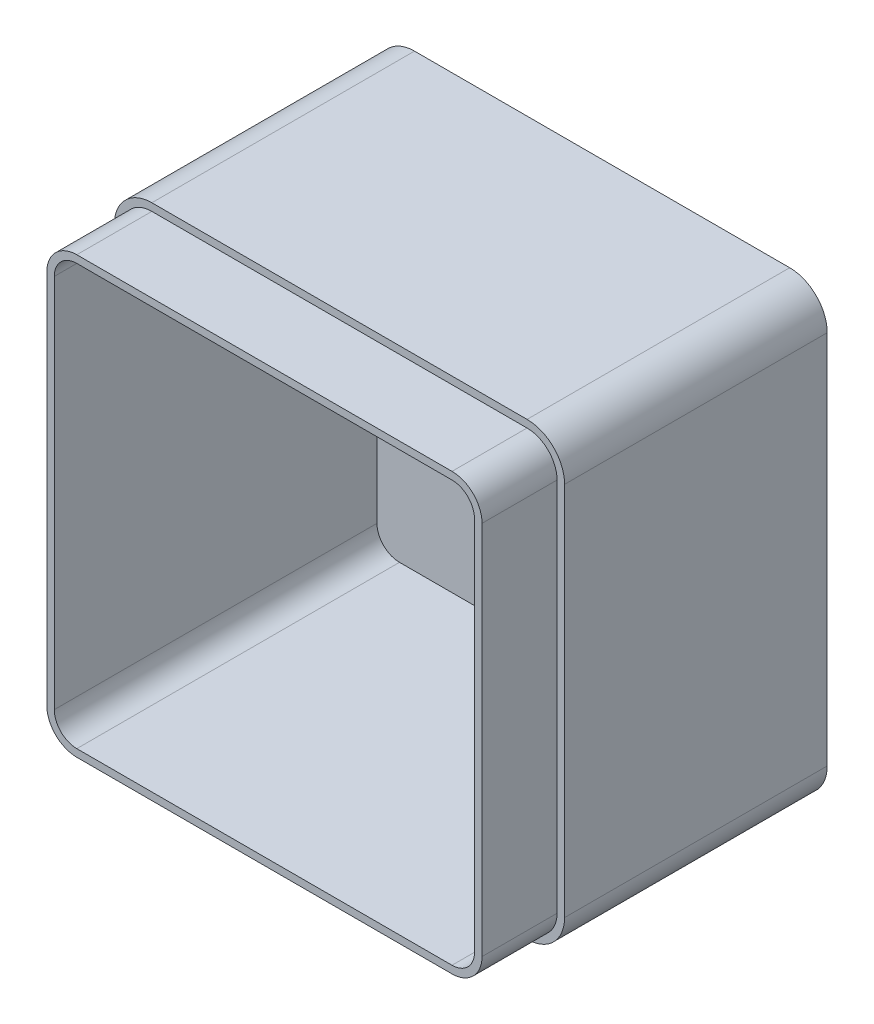
ISO-10303-21;
HEADER;
FILE_DESCRIPTION(('STEP AP214'),'2;1');
FILE_NAME('part.step','',(''),(''),'','','');
FILE_SCHEMA(('AUTOMOTIVE_DESIGN { 1 0 10303 214 1 1 1 1 }'));
ENDSEC;
DATA;
#1=APPLICATION_CONTEXT('core data for automotive mechanical design processes');
#2=APPLICATION_PROTOCOL_DEFINITION('international standard','automotive_design',2000,#1);
#3=PRODUCT_CONTEXT('',#1,'mechanical');
#4=PRODUCT('Part','Part','',(#3));
#5=PRODUCT_RELATED_PRODUCT_CATEGORY('part','',(#4));
#6=PRODUCT_DEFINITION_FORMATION('','',#4);
#7=PRODUCT_DEFINITION_CONTEXT('part definition',#1,'design');
#8=PRODUCT_DEFINITION('design','',#6,#7);
#9=PRODUCT_DEFINITION_SHAPE('','',#8);
#10=(LENGTH_UNIT() NAMED_UNIT(*) SI_UNIT(.MILLI.,.METRE.));
#11=(NAMED_UNIT(*) PLANE_ANGLE_UNIT() SI_UNIT($,.RADIAN.));
#12=(NAMED_UNIT(*) SI_UNIT($,.STERADIAN.) SOLID_ANGLE_UNIT());
#13=UNCERTAINTY_MEASURE_WITH_UNIT(LENGTH_MEASURE(1.E-05),#10,'distance_accuracy_value','');
#14=(GEOMETRIC_REPRESENTATION_CONTEXT(3) GLOBAL_UNCERTAINTY_ASSIGNED_CONTEXT((#13)) GLOBAL_UNIT_ASSIGNED_CONTEXT((#10,
#11,#12)) REPRESENTATION_CONTEXT('',''));
#15=CARTESIAN_POINT('',(0.,0.,0.));
#16=DIRECTION('',(0.,0.,1.));
#17=DIRECTION('',(1.,0.,0.));
#18=AXIS2_PLACEMENT_3D('',#15,#16,#17);
#19=CARTESIAN_POINT('',(0.,0.,90.));
#20=DIRECTION('',(0.,0.,1.));
#21=DIRECTION('',(1.,0.,0.));
#22=AXIS2_PLACEMENT_3D('',#19,#20,#21);
#23=PLANE('',#22);
#24=DIRECTION('',(0.,-1.,0.));
#25=VECTOR('',#24,1.);
#26=CARTESIAN_POINT('',(-52.5864332603939,41.3566739606127,90.));
#27=LINE('',#26,#25);
#28=CARTESIAN_POINT('',(-52.5864332603939,31.3566739606127,90.));
#29=VERTEX_POINT('',#28);
#30=CARTESIAN_POINT('',(-52.5864332603938,-68.6433260393873,90.));
#31=VERTEX_POINT('',#30);
#32=EDGE_CURVE('E349',#29,#31,#27,.T.);
#33=ORIENTED_EDGE('',*,*,#32,.F.);
#34=CARTESIAN_POINT('',(-46.5864332603939,31.3566739606127,90.));
#35=DIRECTION('',(0.,0.,1.));
#36=DIRECTION('',(1.,0.,0.));
#37=AXIS2_PLACEMENT_3D('',#34,#35,#36);
#38=CIRCLE('',#37,6.);
#39=CARTESIAN_POINT('',(-46.5864332603939,37.3566739606127,90.));
#40=VERTEX_POINT('',#39);
#41=EDGE_CURVE('E327',#40,#29,#38,.T.);
#42=ORIENTED_EDGE('',*,*,#41,.F.);
#43=DIRECTION('',(-1.,0.,0.));
#44=VECTOR('',#43,1.);
#45=CARTESIAN_POINT('',(-56.5864332603939,37.3566739606127,90.));
#46=LINE('',#45,#44);
#47=CARTESIAN_POINT('',(53.4135667396061,37.3566739606127,90.));
#48=VERTEX_POINT('',#47);
#49=EDGE_CURVE('E363',#48,#40,#46,.T.);
#50=ORIENTED_EDGE('',*,*,#49,.F.);
#51=CARTESIAN_POINT('',(53.4135667396061,31.3566739606127,90.));
#52=DIRECTION('',(0.,0.,1.));
#53=DIRECTION('',(1.,0.,0.));
#54=AXIS2_PLACEMENT_3D('',#51,#52,#53);
#55=CIRCLE('',#54,6.);
#56=CARTESIAN_POINT('',(59.4135667396061,31.3566739606127,90.));
#57=VERTEX_POINT('',#56);
#58=EDGE_CURVE('E394',#57,#48,#55,.T.);
#59=ORIENTED_EDGE('',*,*,#58,.F.);
#60=DIRECTION('',(0.,1.,0.));
#61=VECTOR('',#60,1.);
#62=CARTESIAN_POINT('',(59.4135667396061,41.3566739606127,90.));
#63=LINE('',#62,#61);
#64=CARTESIAN_POINT('',(59.4135667396061,-68.6433260393873,90.));
#65=VERTEX_POINT('',#64);
#66=EDGE_CURVE('E391',#65,#57,#63,.T.);
#67=ORIENTED_EDGE('',*,*,#66,.F.);
#68=CARTESIAN_POINT('',(53.4135667396061,-68.6433260393873,90.));
#69=DIRECTION('',(0.,0.,1.));
#70=DIRECTION('',(1.,0.,0.));
#71=AXIS2_PLACEMENT_3D('',#68,#69,#70);
#72=CIRCLE('',#71,6.);
#73=CARTESIAN_POINT('',(53.4135667396061,-74.6433260393873,90.));
#74=VERTEX_POINT('',#73);
#75=EDGE_CURVE('E387',#74,#65,#72,.T.);
#76=ORIENTED_EDGE('',*,*,#75,.F.);
#77=DIRECTION('',(1.,0.,0.));
#78=VECTOR('',#77,1.);
#79=CARTESIAN_POINT('',(-56.5864332603938,-74.6433260393873,90.));
#80=LINE('',#79,#78);
#81=CARTESIAN_POINT('',(-46.5864332603939,-74.6433260393873,90.));
#82=VERTEX_POINT('',#81);
#83=EDGE_CURVE('E384',#82,#74,#80,.T.);
#84=ORIENTED_EDGE('',*,*,#83,.F.);
#85=CARTESIAN_POINT('',(-46.5864332603939,-68.6433260393873,90.));
#86=DIRECTION('',(0.,0.,1.));
#87=DIRECTION('',(1.,0.,0.));
#88=AXIS2_PLACEMENT_3D('',#85,#86,#87);
#89=CIRCLE('',#88,6.);
#90=EDGE_CURVE('E372',#31,#82,#89,.T.);
#91=ORIENTED_EDGE('',*,*,#90,.F.);
#92=EDGE_LOOP('',(#33,#42,#50,#59,#67,#76,#84,#91));
#93=FACE_BOUND('',#92,.T.);
#94=DIRECTION('',(-1.,0.,0.));
#95=VECTOR('',#94,1.);
#96=CARTESIAN_POINT('',(53.4135667396061,39.3566739606127,90.));
#97=LINE('',#96,#95);
#98=CARTESIAN_POINT('',(53.4135667396061,39.3566739606127,90.));
#99=VERTEX_POINT('',#98);
#100=CARTESIAN_POINT('',(-46.5864332603939,39.3566739606127,90.));
#101=VERTEX_POINT('',#100);
#102=EDGE_CURVE('E228',#99,#101,#97,.T.);
#103=ORIENTED_EDGE('',*,*,#102,.T.);
#104=CARTESIAN_POINT('',(-46.5864332603939,31.3566739606127,90.));
#105=DIRECTION('',(0.,0.,1.));
#106=DIRECTION('',(1.,0.,0.));
#107=AXIS2_PLACEMENT_3D('',#104,#105,#106);
#108=CIRCLE('',#107,7.99999999999999);
#109=CARTESIAN_POINT('',(-54.5864332603939,31.3566739606127,90.));
#110=VERTEX_POINT('',#109);
#111=EDGE_CURVE('E255',#101,#110,#108,.T.);
#112=ORIENTED_EDGE('',*,*,#111,.T.);
#113=DIRECTION('',(0.,-1.,0.));
#114=VECTOR('',#113,1.);
#115=CARTESIAN_POINT('',(-54.5864332603939,31.3566739606127,90.));
#116=LINE('',#115,#114);
#117=CARTESIAN_POINT('',(-54.5864332603939,-68.6433260393873,90.));
#118=VERTEX_POINT('',#117);
#119=EDGE_CURVE('E205',#110,#118,#116,.T.);
#120=ORIENTED_EDGE('',*,*,#119,.T.);
#121=CARTESIAN_POINT('',(-46.5864332603939,-68.6433260393873,90.));
#122=DIRECTION('',(0.,0.,1.));
#123=DIRECTION('',(1.,0.,0.));
#124=AXIS2_PLACEMENT_3D('',#121,#122,#123);
#125=CIRCLE('',#124,8.);
#126=CARTESIAN_POINT('',(-46.5864332603939,-76.6433260393873,90.));
#127=VERTEX_POINT('',#126);
#128=EDGE_CURVE('E54',#118,#127,#125,.T.);
#129=ORIENTED_EDGE('',*,*,#128,.T.);
#130=DIRECTION('',(1.,0.,0.));
#131=VECTOR('',#130,1.);
#132=CARTESIAN_POINT('',(-46.5864332603939,-76.6433260393873,90.));
#133=LINE('',#132,#131);
#134=CARTESIAN_POINT('',(53.4135667396061,-76.6433260393873,90.));
#135=VERTEX_POINT('',#134);
#136=EDGE_CURVE('E262',#127,#135,#133,.T.);
#137=ORIENTED_EDGE('',*,*,#136,.T.);
#138=CARTESIAN_POINT('',(53.4135667396061,-68.6433260393873,90.));
#139=DIRECTION('',(0.,0.,1.));
#140=DIRECTION('',(1.,0.,0.));
#141=AXIS2_PLACEMENT_3D('',#138,#139,#140);
#142=CIRCLE('',#141,7.99999999999999);
#143=CARTESIAN_POINT('',(61.4135667396061,-68.6433260393873,90.));
#144=VERTEX_POINT('',#143);
#145=EDGE_CURVE('E266',#135,#144,#142,.T.);
#146=ORIENTED_EDGE('',*,*,#145,.T.);
#147=DIRECTION('',(0.,1.,0.));
#148=VECTOR('',#147,1.);
#149=CARTESIAN_POINT('',(61.4135667396061,-68.6433260393873,90.));
#150=LINE('',#149,#148);
#151=CARTESIAN_POINT('',(61.4135667396061,31.3566739606127,90.));
#152=VERTEX_POINT('',#151);
#153=EDGE_CURVE('E270',#144,#152,#150,.T.);
#154=ORIENTED_EDGE('',*,*,#153,.T.);
#155=CARTESIAN_POINT('',(53.4135667396061,31.3566739606127,90.));
#156=DIRECTION('',(0.,0.,1.));
#157=DIRECTION('',(1.,0.,0.));
#158=AXIS2_PLACEMENT_3D('',#155,#156,#157);
#159=CIRCLE('',#158,8.);
#160=EDGE_CURVE('E232',#152,#99,#159,.T.);
#161=ORIENTED_EDGE('',*,*,#160,.T.);
#162=EDGE_LOOP('',(#103,#112,#120,#129,#137,#146,#154,#161));
#163=FACE_BOUND('',#162,.T.);
#164=ADVANCED_FACE('F38',(#93,#163),#23,.T.);
#165=CARTESIAN_POINT('',(-52.5864332603939,41.3566739606127,90.));
#166=DIRECTION('',(1.,0.,0.));
#167=DIRECTION('',(0.,1.,0.));
#168=AXIS2_PLACEMENT_3D('',#165,#166,#167);
#169=PLANE('',#168);
#170=DIRECTION('',(0.,-1.,0.));
#171=VECTOR('',#170,1.);
#172=CARTESIAN_POINT('',(-52.5864332603939,41.3566739606127,4.));
#173=LINE('',#172,#171);
#174=CARTESIAN_POINT('',(-52.5864332603939,31.3566739606127,4.));
#175=VERTEX_POINT('',#174);
#176=CARTESIAN_POINT('',(-52.5864332603938,-68.6433260393873,4.));
#177=VERTEX_POINT('',#176);
#178=EDGE_CURVE('E319',#175,#177,#173,.T.);
#179=ORIENTED_EDGE('',*,*,#178,.F.);
#180=DIRECTION('',(0.,0.,1.));
#181=VECTOR('',#180,1.);
#182=CARTESIAN_POINT('',(-52.5864332603939,31.3566739606127,90.));
#183=LINE('',#182,#181);
#184=EDGE_CURVE('E328',#29,#175,#183,.F.);
#185=ORIENTED_EDGE('',*,*,#184,.F.);
#186=ORIENTED_EDGE('',*,*,#32,.T.);
#187=DIRECTION('',(0.,0.,1.));
#188=VECTOR('',#187,1.);
#189=CARTESIAN_POINT('',(-52.5864332603938,-68.6433260393873,90.));
#190=LINE('',#189,#188);
#191=EDGE_CURVE('E324',#177,#31,#190,.T.);
#192=ORIENTED_EDGE('',*,*,#191,.F.);
#193=EDGE_LOOP('',(#179,#185,#186,#192));
#194=FACE_BOUND('',#193,.T.);
#195=ADVANCED_FACE('F504',(#194),#169,.T.);
#196=CARTESIAN_POINT('',(-56.5864332603938,-74.6433260393873,90.));
#197=DIRECTION('',(0.,1.,0.));
#198=DIRECTION('',(0.,0.,1.));
#199=AXIS2_PLACEMENT_3D('',#196,#197,#198);
#200=PLANE('',#199);
#201=ORIENTED_EDGE('',*,*,#83,.T.);
#202=DIRECTION('',(0.,0.,1.));
#203=VECTOR('',#202,1.);
#204=CARTESIAN_POINT('',(53.4135667396061,-74.6433260393873,90.));
#205=LINE('',#204,#203);
#206=CARTESIAN_POINT('',(53.4135667396061,-74.6433260393873,4.));
#207=VERTEX_POINT('',#206);
#208=EDGE_CURVE('E360',#207,#74,#205,.T.);
#209=ORIENTED_EDGE('',*,*,#208,.F.);
#210=DIRECTION('',(1.,0.,0.));
#211=VECTOR('',#210,1.);
#212=CARTESIAN_POINT('',(-56.5864332603938,-74.6433260393873,4.));
#213=LINE('',#212,#211);
#214=CARTESIAN_POINT('',(-46.5864332603939,-74.6433260393873,4.));
#215=VERTEX_POINT('',#214);
#216=EDGE_CURVE('E323',#215,#207,#213,.T.);
#217=ORIENTED_EDGE('',*,*,#216,.F.);
#218=DIRECTION('',(0.,0.,1.));
#219=VECTOR('',#218,1.);
#220=CARTESIAN_POINT('',(-46.5864332603939,-74.6433260393873,90.));
#221=LINE('',#220,#219);
#222=EDGE_CURVE('E344',#82,#215,#221,.F.);
#223=ORIENTED_EDGE('',*,*,#222,.F.);
#224=EDGE_LOOP('',(#201,#209,#217,#223));
#225=FACE_BOUND('',#224,.T.);
#226=ADVANCED_FACE('F510',(#225),#200,.T.);
#227=CARTESIAN_POINT('',(59.4135667396061,41.3566739606127,90.));
#228=DIRECTION('',(-1.,0.,0.));
#229=DIRECTION('',(0.,-1.,0.));
#230=AXIS2_PLACEMENT_3D('',#227,#228,#229);
#231=PLANE('',#230);
#232=ORIENTED_EDGE('',*,*,#66,.T.);
#233=DIRECTION('',(0.,0.,1.));
#234=VECTOR('',#233,1.);
#235=CARTESIAN_POINT('',(59.4135667396061,31.3566739606127,90.));
#236=LINE('',#235,#234);
#237=CARTESIAN_POINT('',(59.4135667396061,31.3566739606127,4.));
#238=VERTEX_POINT('',#237);
#239=EDGE_CURVE('E369',#238,#57,#236,.T.);
#240=ORIENTED_EDGE('',*,*,#239,.F.);
#241=DIRECTION('',(0.,1.,0.));
#242=VECTOR('',#241,1.);
#243=CARTESIAN_POINT('',(59.4135667396061,41.3566739606127,4.));
#244=LINE('',#243,#242);
#245=CARTESIAN_POINT('',(59.4135667396061,-68.6433260393873,4.));
#246=VERTEX_POINT('',#245);
#247=EDGE_CURVE('E336',#246,#238,#244,.T.);
#248=ORIENTED_EDGE('',*,*,#247,.F.);
#249=DIRECTION('',(0.,0.,1.));
#250=VECTOR('',#249,1.);
#251=CARTESIAN_POINT('',(59.4135667396061,-68.6433260393873,90.));
#252=LINE('',#251,#250);
#253=EDGE_CURVE('E364',#65,#246,#252,.F.);
#254=ORIENTED_EDGE('',*,*,#253,.F.);
#255=EDGE_LOOP('',(#232,#240,#248,#254));
#256=FACE_BOUND('',#255,.T.);
#257=ADVANCED_FACE('F539',(#256),#231,.T.);
#258=CARTESIAN_POINT('',(-56.5864332603939,37.3566739606127,90.));
#259=DIRECTION('',(0.,-1.,0.));
#260=DIRECTION('',(0.,0.,-1.));
#261=AXIS2_PLACEMENT_3D('',#258,#259,#260);
#262=PLANE('',#261);
#263=ORIENTED_EDGE('',*,*,#49,.T.);
#264=DIRECTION('',(0.,0.,-1.));
#265=VECTOR('',#264,1.);
#266=CARTESIAN_POINT('',(-46.5864332603939,37.3566739606127,90.));
#267=LINE('',#266,#265);
#268=CARTESIAN_POINT('',(-46.5864332603939,37.3566739606127,4.));
#269=VERTEX_POINT('',#268);
#270=EDGE_CURVE('E368',#269,#40,#267,.F.);
#271=ORIENTED_EDGE('',*,*,#270,.F.);
#272=DIRECTION('',(-1.,0.,0.));
#273=VECTOR('',#272,1.);
#274=CARTESIAN_POINT('',(-56.5864332603939,37.3566739606127,4.));
#275=LINE('',#274,#273);
#276=CARTESIAN_POINT('',(53.4135667396061,37.3566739606127,4.));
#277=VERTEX_POINT('',#276);
#278=EDGE_CURVE('E345',#277,#269,#275,.T.);
#279=ORIENTED_EDGE('',*,*,#278,.F.);
#280=DIRECTION('',(0.,0.,-1.));
#281=VECTOR('',#280,1.);
#282=CARTESIAN_POINT('',(53.4135667396061,37.3566739606127,90.));
#283=LINE('',#282,#281);
#284=EDGE_CURVE('E373',#48,#277,#283,.T.);
#285=ORIENTED_EDGE('',*,*,#284,.F.);
#286=EDGE_LOOP('',(#263,#271,#279,#285));
#287=FACE_BOUND('',#286,.T.);
#288=ADVANCED_FACE('F535',(#287),#262,.T.);
#289=CARTESIAN_POINT('',(0.,0.,4.));
#290=DIRECTION('',(0.,0.,1.));
#291=DIRECTION('',(1.,0.,0.));
#292=AXIS2_PLACEMENT_3D('',#289,#290,#291);
#293=PLANE('',#292);
#294=ORIENTED_EDGE('',*,*,#216,.T.);
#295=CARTESIAN_POINT('',(53.4135667396061,-68.6433260393873,4.));
#296=DIRECTION('',(0.,0.,1.));
#297=DIRECTION('',(1.,0.,0.));
#298=AXIS2_PLACEMENT_3D('',#295,#296,#297);
#299=CIRCLE('',#298,6.);
#300=EDGE_CURVE('E339',#246,#207,#299,.F.);
#301=ORIENTED_EDGE('',*,*,#300,.F.);
#302=ORIENTED_EDGE('',*,*,#247,.T.);
#303=CARTESIAN_POINT('',(53.4135667396061,31.3566739606127,4.));
#304=DIRECTION('',(0.,0.,1.));
#305=DIRECTION('',(1.,0.,0.));
#306=AXIS2_PLACEMENT_3D('',#303,#304,#305);
#307=CIRCLE('',#306,6.);
#308=EDGE_CURVE('E343',#277,#238,#307,.F.);
#309=ORIENTED_EDGE('',*,*,#308,.F.);
#310=ORIENTED_EDGE('',*,*,#278,.T.);
#311=CARTESIAN_POINT('',(-46.5864332603939,31.3566739606127,4.));
#312=DIRECTION('',(0.,0.,1.));
#313=DIRECTION('',(1.,0.,0.));
#314=AXIS2_PLACEMENT_3D('',#311,#312,#313);
#315=CIRCLE('',#314,6.);
#316=EDGE_CURVE('E340',#175,#269,#315,.F.);
#317=ORIENTED_EDGE('',*,*,#316,.F.);
#318=ORIENTED_EDGE('',*,*,#178,.T.);
#319=CARTESIAN_POINT('',(-46.5864332603939,-68.6433260393873,4.));
#320=DIRECTION('',(0.,0.,1.));
#321=DIRECTION('',(1.,0.,0.));
#322=AXIS2_PLACEMENT_3D('',#319,#320,#321);
#323=CIRCLE('',#322,6.);
#324=EDGE_CURVE('E332',#215,#177,#323,.F.);
#325=ORIENTED_EDGE('',*,*,#324,.F.);
#326=EDGE_LOOP('',(#294,#301,#302,#309,#310,#317,#318,#325));
#327=FACE_BOUND('',#326,.T.);
#328=ADVANCED_FACE('F531',(#327),#293,.T.);
#329=CARTESIAN_POINT('',(-46.5864332603939,-68.6433260393873,90.));
#330=DIRECTION('',(0.,0.,-1.));
#331=DIRECTION('',(-1.,0.,0.));
#332=AXIS2_PLACEMENT_3D('',#329,#330,#331);
#333=CYLINDRICAL_SURFACE('',#332,6.);
#334=ORIENTED_EDGE('',*,*,#90,.T.);
#335=ORIENTED_EDGE('',*,*,#222,.T.);
#336=ORIENTED_EDGE('',*,*,#324,.T.);
#337=ORIENTED_EDGE('',*,*,#191,.T.);
#338=EDGE_LOOP('',(#334,#335,#336,#337));
#339=FACE_BOUND('',#338,.T.);
#340=ADVANCED_FACE('F527',(#339),#333,.F.);
#341=CARTESIAN_POINT('',(53.4135667396061,-68.6433260393873,90.));
#342=DIRECTION('',(0.,0.,-1.));
#343=DIRECTION('',(-1.,0.,0.));
#344=AXIS2_PLACEMENT_3D('',#341,#342,#343);
#345=CYLINDRICAL_SURFACE('',#344,6.);
#346=ORIENTED_EDGE('',*,*,#75,.T.);
#347=ORIENTED_EDGE('',*,*,#253,.T.);
#348=ORIENTED_EDGE('',*,*,#300,.T.);
#349=ORIENTED_EDGE('',*,*,#208,.T.);
#350=EDGE_LOOP('',(#346,#347,#348,#349));
#351=FACE_BOUND('',#350,.T.);
#352=ADVANCED_FACE('F523',(#351),#345,.F.);
#353=CARTESIAN_POINT('',(53.4135667396061,31.3566739606127,90.));
#354=DIRECTION('',(0.,0.,-1.));
#355=DIRECTION('',(-1.,0.,0.));
#356=AXIS2_PLACEMENT_3D('',#353,#354,#355);
#357=CYLINDRICAL_SURFACE('',#356,6.);
#358=ORIENTED_EDGE('',*,*,#58,.T.);
#359=ORIENTED_EDGE('',*,*,#284,.T.);
#360=ORIENTED_EDGE('',*,*,#308,.T.);
#361=ORIENTED_EDGE('',*,*,#239,.T.);
#362=EDGE_LOOP('',(#358,#359,#360,#361));
#363=FACE_BOUND('',#362,.T.);
#364=ADVANCED_FACE('F519',(#363),#357,.F.);
#365=CARTESIAN_POINT('',(-46.5864332603939,31.3566739606127,90.));
#366=DIRECTION('',(0.,0.,-1.));
#367=DIRECTION('',(-1.,0.,0.));
#368=AXIS2_PLACEMENT_3D('',#365,#366,#367);
#369=CYLINDRICAL_SURFACE('',#368,6.);
#370=ORIENTED_EDGE('',*,*,#41,.T.);
#371=ORIENTED_EDGE('',*,*,#184,.T.);
#372=ORIENTED_EDGE('',*,*,#316,.T.);
#373=ORIENTED_EDGE('',*,*,#270,.T.);
#374=EDGE_LOOP('',(#370,#371,#372,#373));
#375=FACE_BOUND('',#374,.T.);
#376=ADVANCED_FACE('F516',(#375),#369,.F.);
#377=CARTESIAN_POINT('',(-46.5864332603939,31.3566739606127,70.));
#378=DIRECTION('',(0.,0.,1.));
#379=DIRECTION('',(1.,0.,0.));
#380=AXIS2_PLACEMENT_3D('',#377,#378,#379);
#381=PLANE('',#380);
#382=DIRECTION('',(-1.,0.,0.));
#383=VECTOR('',#382,1.);
#384=CARTESIAN_POINT('',(53.4135667396061,39.3566739606127,70.));
#385=LINE('',#384,#383);
#386=CARTESIAN_POINT('',(53.4135667396061,39.3566739606127,70.));
#387=VERTEX_POINT('',#386);
#388=CARTESIAN_POINT('',(-46.5864332603939,39.3566739606127,70.));
#389=VERTEX_POINT('',#388);
#390=EDGE_CURVE('E212',#387,#389,#385,.T.);
#391=ORIENTED_EDGE('',*,*,#390,.F.);
#392=CARTESIAN_POINT('',(53.4135667396061,31.3566739606127,70.));
#393=DIRECTION('',(0.,0.,1.));
#394=DIRECTION('',(1.,0.,0.));
#395=AXIS2_PLACEMENT_3D('',#392,#393,#394);
#396=CIRCLE('',#395,8.);
#397=CARTESIAN_POINT('',(61.4135667396061,31.3566739606127,70.));
#398=VERTEX_POINT('',#397);
#399=EDGE_CURVE('E249',#398,#387,#396,.T.);
#400=ORIENTED_EDGE('',*,*,#399,.F.);
#401=DIRECTION('',(0.,1.,0.));
#402=VECTOR('',#401,1.);
#403=CARTESIAN_POINT('',(61.4135667396061,-68.6433260393873,70.));
#404=LINE('',#403,#402);
#405=CARTESIAN_POINT('',(61.4135667396061,-68.6433260393873,70.));
#406=VERTEX_POINT('',#405);
#407=EDGE_CURVE('E245',#406,#398,#404,.T.);
#408=ORIENTED_EDGE('',*,*,#407,.F.);
#409=CARTESIAN_POINT('',(53.4135667396061,-68.6433260393873,70.));
#410=DIRECTION('',(0.,0.,1.));
#411=DIRECTION('',(1.,0.,0.));
#412=AXIS2_PLACEMENT_3D('',#409,#410,#411);
#413=CIRCLE('',#412,7.99999999999999);
#414=CARTESIAN_POINT('',(53.4135667396061,-76.6433260393873,70.));
#415=VERTEX_POINT('',#414);
#416=EDGE_CURVE('E241',#415,#406,#413,.T.);
#417=ORIENTED_EDGE('',*,*,#416,.F.);
#418=DIRECTION('',(1.,0.,0.));
#419=VECTOR('',#418,1.);
#420=CARTESIAN_POINT('',(-46.5864332603939,-76.6433260393873,70.));
#421=LINE('',#420,#419);
#422=CARTESIAN_POINT('',(-46.5864332603939,-76.6433260393873,70.));
#423=VERTEX_POINT('',#422);
#424=EDGE_CURVE('E237',#423,#415,#421,.T.);
#425=ORIENTED_EDGE('',*,*,#424,.F.);
#426=CARTESIAN_POINT('',(-46.5864332603939,-68.6433260393873,70.));
#427=DIRECTION('',(0.,0.,1.));
#428=DIRECTION('',(1.,0.,0.));
#429=AXIS2_PLACEMENT_3D('',#426,#427,#428);
#430=CIRCLE('',#429,8.);
#431=CARTESIAN_POINT('',(-54.5864332603939,-68.6433260393873,70.));
#432=VERTEX_POINT('',#431);
#433=EDGE_CURVE('E222',#432,#423,#430,.T.);
#434=ORIENTED_EDGE('',*,*,#433,.F.);
#435=DIRECTION('',(0.,-1.,0.));
#436=VECTOR('',#435,1.);
#437=CARTESIAN_POINT('',(-54.5864332603939,31.3566739606127,70.));
#438=LINE('',#437,#436);
#439=CARTESIAN_POINT('',(-54.5864332603939,31.3566739606127,70.));
#440=VERTEX_POINT('',#439);
#441=EDGE_CURVE('E203',#440,#432,#438,.T.);
#442=ORIENTED_EDGE('',*,*,#441,.F.);
#443=CARTESIAN_POINT('',(-46.5864332603939,31.3566739606127,70.));
#444=DIRECTION('',(0.,0.,1.));
#445=DIRECTION('',(1.,0.,0.));
#446=AXIS2_PLACEMENT_3D('',#443,#444,#445);
#447=CIRCLE('',#446,7.99999999999999);
#448=EDGE_CURVE('E218',#389,#440,#447,.T.);
#449=ORIENTED_EDGE('',*,*,#448,.F.);
#450=EDGE_LOOP('',(#391,#400,#408,#417,#425,#434,#442,#449));
#451=FACE_BOUND('',#450,.T.);
#452=CARTESIAN_POINT('',(-46.5864332603939,31.3566739606127,70.));
#453=DIRECTION('',(0.,0.,1.));
#454=DIRECTION('',(1.,0.,0.));
#455=AXIS2_PLACEMENT_3D('',#452,#453,#454);
#456=CIRCLE('',#455,9.99999999999999);
#457=CARTESIAN_POINT('',(-46.5864332603939,41.3566739606127,70.));
#458=VERTEX_POINT('',#457);
#459=CARTESIAN_POINT('',(-56.5864332603939,31.3566739606127,70.));
#460=VERTEX_POINT('',#459);
#461=EDGE_CURVE('E279',#458,#460,#456,.T.);
#462=ORIENTED_EDGE('',*,*,#461,.T.);
#463=DIRECTION('',(0.,-1.,0.));
#464=VECTOR('',#463,1.);
#465=CARTESIAN_POINT('',(-56.5864332603939,31.3566739606127,70.));
#466=LINE('',#465,#464);
#467=CARTESIAN_POINT('',(-56.5864332603938,-68.6433260393873,70.));
#468=VERTEX_POINT('',#467);
#469=EDGE_CURVE('E299',#460,#468,#466,.T.);
#470=ORIENTED_EDGE('',*,*,#469,.T.);
#471=CARTESIAN_POINT('',(-46.5864332603939,-68.6433260393873,70.));
#472=DIRECTION('',(0.,0.,1.));
#473=DIRECTION('',(1.,0.,0.));
#474=AXIS2_PLACEMENT_3D('',#471,#472,#473);
#475=CIRCLE('',#474,9.99999999999999);
#476=CARTESIAN_POINT('',(-46.5864332603939,-78.6433260393873,70.));
#477=VERTEX_POINT('',#476);
#478=EDGE_CURVE('E302',#468,#477,#475,.T.);
#479=ORIENTED_EDGE('',*,*,#478,.T.);
#480=DIRECTION('',(1.,0.,0.));
#481=VECTOR('',#480,1.);
#482=CARTESIAN_POINT('',(-46.5864332603939,-78.6433260393873,70.));
#483=LINE('',#482,#481);
#484=CARTESIAN_POINT('',(53.4135667396061,-78.6433260393873,70.));
#485=VERTEX_POINT('',#484);
#486=EDGE_CURVE('E305',#477,#485,#483,.T.);
#487=ORIENTED_EDGE('',*,*,#486,.T.);
#488=CARTESIAN_POINT('',(53.4135667396061,-68.6433260393873,70.));
#489=DIRECTION('',(0.,0.,1.));
#490=DIRECTION('',(1.,0.,0.));
#491=AXIS2_PLACEMENT_3D('',#488,#489,#490);
#492=CIRCLE('',#491,9.99999999999999);
#493=CARTESIAN_POINT('',(63.4135667396061,-68.6433260393873,70.));
#494=VERTEX_POINT('',#493);
#495=EDGE_CURVE('E308',#485,#494,#492,.T.);
#496=ORIENTED_EDGE('',*,*,#495,.T.);
#497=DIRECTION('',(0.,1.,0.));
#498=VECTOR('',#497,1.);
#499=CARTESIAN_POINT('',(63.4135667396061,-68.6433260393873,70.));
#500=LINE('',#499,#498);
#501=CARTESIAN_POINT('',(63.4135667396061,31.3566739606127,70.));
#502=VERTEX_POINT('',#501);
#503=EDGE_CURVE('E311',#494,#502,#500,.T.);
#504=ORIENTED_EDGE('',*,*,#503,.T.);
#505=CARTESIAN_POINT('',(53.4135667396061,31.3566739606127,70.));
#506=DIRECTION('',(0.,0.,1.));
#507=DIRECTION('',(1.,0.,0.));
#508=AXIS2_PLACEMENT_3D('',#505,#506,#507);
#509=CIRCLE('',#508,9.99999999999999);
#510=CARTESIAN_POINT('',(53.4135667396061,41.3566739606127,70.));
#511=VERTEX_POINT('',#510);
#512=EDGE_CURVE('E314',#502,#511,#509,.T.);
#513=ORIENTED_EDGE('',*,*,#512,.T.);
#514=DIRECTION('',(-1.,0.,0.));
#515=VECTOR('',#514,1.);
#516=CARTESIAN_POINT('',(53.4135667396061,41.3566739606127,70.));
#517=LINE('',#516,#515);
#518=EDGE_CURVE('E62',#511,#458,#517,.T.);
#519=ORIENTED_EDGE('',*,*,#518,.T.);
#520=EDGE_LOOP('',(#462,#470,#479,#487,#496,#504,#513,#519));
#521=FACE_BOUND('',#520,.T.);
#522=ADVANCED_FACE('F217',(#451,#521),#381,.T.);
#523=CARTESIAN_POINT('',(-46.5864332603939,31.3566739606127,70.));
#524=DIRECTION('',(0.,0.,1.));
#525=DIRECTION('',(1.,0.,0.));
#526=AXIS2_PLACEMENT_3D('',#523,#524,#525);
#527=CYLINDRICAL_SURFACE('',#526,7.99999999999999);
#528=ORIENTED_EDGE('',*,*,#111,.F.);
#529=DIRECTION('',(0.,0.,1.));
#530=VECTOR('',#529,1.);
#531=CARTESIAN_POINT('',(-46.5864332603939,39.3566739606127,70.));
#532=LINE('',#531,#530);
#533=EDGE_CURVE('E226',#389,#101,#532,.T.);
#534=ORIENTED_EDGE('',*,*,#533,.F.);
#535=ORIENTED_EDGE('',*,*,#448,.T.);
#536=DIRECTION('',(0.,0.,1.));
#537=VECTOR('',#536,1.);
#538=CARTESIAN_POINT('',(-54.5864332603939,31.3566739606127,70.));
#539=LINE('',#538,#537);
#540=EDGE_CURVE('E200',#440,#110,#539,.T.);
#541=ORIENTED_EDGE('',*,*,#540,.T.);
#542=EDGE_LOOP('',(#528,#534,#535,#541));
#543=FACE_BOUND('',#542,.T.);
#544=ADVANCED_FACE('F225',(#543),#527,.T.);
#545=CARTESIAN_POINT('',(53.4135667396061,39.3566739606127,70.));
#546=DIRECTION('',(0.,1.,0.));
#547=DIRECTION('',(0.,0.,1.));
#548=AXIS2_PLACEMENT_3D('',#545,#546,#547);
#549=PLANE('',#548);
#550=ORIENTED_EDGE('',*,*,#102,.F.);
#551=DIRECTION('',(0.,0.,1.));
#552=VECTOR('',#551,1.);
#553=CARTESIAN_POINT('',(53.4135667396061,39.3566739606127,70.));
#554=LINE('',#553,#552);
#555=EDGE_CURVE('E280',#387,#99,#554,.T.);
#556=ORIENTED_EDGE('',*,*,#555,.F.);
#557=ORIENTED_EDGE('',*,*,#390,.T.);
#558=ORIENTED_EDGE('',*,*,#533,.T.);
#559=EDGE_LOOP('',(#550,#556,#557,#558));
#560=FACE_BOUND('',#559,.T.);
#561=ADVANCED_FACE('F550',(#560),#549,.T.);
#562=CARTESIAN_POINT('',(53.4135667396061,31.3566739606127,70.));
#563=DIRECTION('',(0.,0.,1.));
#564=DIRECTION('',(1.,0.,0.));
#565=AXIS2_PLACEMENT_3D('',#562,#563,#564);
#566=CYLINDRICAL_SURFACE('',#565,8.);
#567=ORIENTED_EDGE('',*,*,#160,.F.);
#568=DIRECTION('',(0.,0.,1.));
#569=VECTOR('',#568,1.);
#570=CARTESIAN_POINT('',(61.4135667396061,31.3566739606127,70.));
#571=LINE('',#570,#569);
#572=EDGE_CURVE('E283',#398,#152,#571,.T.);
#573=ORIENTED_EDGE('',*,*,#572,.F.);
#574=ORIENTED_EDGE('',*,*,#399,.T.);
#575=ORIENTED_EDGE('',*,*,#555,.T.);
#576=EDGE_LOOP('',(#567,#573,#574,#575));
#577=FACE_BOUND('',#576,.T.);
#578=ADVANCED_FACE('F565',(#577),#566,.T.);
#579=CARTESIAN_POINT('',(61.4135667396061,-68.6433260393873,70.));
#580=DIRECTION('',(1.,0.,0.));
#581=DIRECTION('',(0.,0.,-1.));
#582=AXIS2_PLACEMENT_3D('',#579,#580,#581);
#583=PLANE('',#582);
#584=ORIENTED_EDGE('',*,*,#153,.F.);
#585=DIRECTION('',(0.,0.,1.));
#586=VECTOR('',#585,1.);
#587=CARTESIAN_POINT('',(61.4135667396061,-68.6433260393873,70.));
#588=LINE('',#587,#586);
#589=EDGE_CURVE('E286',#406,#144,#588,.T.);
#590=ORIENTED_EDGE('',*,*,#589,.F.);
#591=ORIENTED_EDGE('',*,*,#407,.T.);
#592=ORIENTED_EDGE('',*,*,#572,.T.);
#593=EDGE_LOOP('',(#584,#590,#591,#592));
#594=FACE_BOUND('',#593,.T.);
#595=ADVANCED_FACE('F561',(#594),#583,.T.);
#596=CARTESIAN_POINT('',(53.4135667396061,-68.6433260393873,70.));
#597=DIRECTION('',(0.,0.,1.));
#598=DIRECTION('',(1.,0.,0.));
#599=AXIS2_PLACEMENT_3D('',#596,#597,#598);
#600=CYLINDRICAL_SURFACE('',#599,7.99999999999999);
#601=ORIENTED_EDGE('',*,*,#145,.F.);
#602=DIRECTION('',(0.,0.,1.));
#603=VECTOR('',#602,1.);
#604=CARTESIAN_POINT('',(53.4135667396061,-76.6433260393873,70.));
#605=LINE('',#604,#603);
#606=EDGE_CURVE('E289',#415,#135,#605,.T.);
#607=ORIENTED_EDGE('',*,*,#606,.F.);
#608=ORIENTED_EDGE('',*,*,#416,.T.);
#609=ORIENTED_EDGE('',*,*,#589,.T.);
#610=EDGE_LOOP('',(#601,#607,#608,#609));
#611=FACE_BOUND('',#610,.T.);
#612=ADVANCED_FACE('F557',(#611),#600,.T.);
#613=CARTESIAN_POINT('',(-46.5864332603939,-76.6433260393873,70.));
#614=DIRECTION('',(0.,-1.,0.));
#615=DIRECTION('',(0.,0.,-1.));
#616=AXIS2_PLACEMENT_3D('',#613,#614,#615);
#617=PLANE('',#616);
#618=ORIENTED_EDGE('',*,*,#136,.F.);
#619=DIRECTION('',(0.,0.,1.));
#620=VECTOR('',#619,1.);
#621=CARTESIAN_POINT('',(-46.5864332603939,-76.6433260393873,70.));
#622=LINE('',#621,#620);
#623=EDGE_CURVE('E292',#423,#127,#622,.T.);
#624=ORIENTED_EDGE('',*,*,#623,.F.);
#625=ORIENTED_EDGE('',*,*,#424,.T.);
#626=ORIENTED_EDGE('',*,*,#606,.T.);
#627=EDGE_LOOP('',(#618,#624,#625,#626));
#628=FACE_BOUND('',#627,.T.);
#629=ADVANCED_FACE('F554',(#628),#617,.T.);
#630=CARTESIAN_POINT('',(-46.5864332603939,-68.6433260393873,70.));
#631=DIRECTION('',(0.,0.,1.));
#632=DIRECTION('',(1.,0.,0.));
#633=AXIS2_PLACEMENT_3D('',#630,#631,#632);
#634=CYLINDRICAL_SURFACE('',#633,8.);
#635=ORIENTED_EDGE('',*,*,#128,.F.);
#636=DIRECTION('',(0.,0.,1.));
#637=VECTOR('',#636,1.);
#638=CARTESIAN_POINT('',(-54.5864332603939,-68.6433260393873,70.));
#639=LINE('',#638,#637);
#640=EDGE_CURVE('E211',#432,#118,#639,.T.);
#641=ORIENTED_EDGE('',*,*,#640,.F.);
#642=ORIENTED_EDGE('',*,*,#433,.T.);
#643=ORIENTED_EDGE('',*,*,#623,.T.);
#644=EDGE_LOOP('',(#635,#641,#642,#643));
#645=FACE_BOUND('',#644,.T.);
#646=ADVANCED_FACE('F499',(#645),#634,.T.);
#647=CARTESIAN_POINT('',(-54.5864332603939,31.3566739606127,70.));
#648=DIRECTION('',(-1.,0.,0.));
#649=DIRECTION('',(0.,0.,1.));
#650=AXIS2_PLACEMENT_3D('',#647,#648,#649);
#651=PLANE('',#650);
#652=ORIENTED_EDGE('',*,*,#119,.F.);
#653=ORIENTED_EDGE('',*,*,#540,.F.);
#654=ORIENTED_EDGE('',*,*,#441,.T.);
#655=ORIENTED_EDGE('',*,*,#640,.T.);
#656=EDGE_LOOP('',(#652,#653,#654,#655));
#657=FACE_BOUND('',#656,.T.);
#658=ADVANCED_FACE('F202',(#657),#651,.T.);
#659=CARTESIAN_POINT('',(0.,0.,0.));
#660=DIRECTION('',(0.,0.,1.));
#661=DIRECTION('',(1.,0.,0.));
#662=AXIS2_PLACEMENT_3D('',#659,#660,#661);
#663=PLANE('',#662);
#664=DIRECTION('',(1.,0.,0.));
#665=VECTOR('',#664,1.);
#666=CARTESIAN_POINT('',(-56.5864332603938,-78.6433260393873,0.));
#667=LINE('',#666,#665);
#668=CARTESIAN_POINT('',(-46.5864332603939,-78.6433260393873,0.));
#669=VERTEX_POINT('',#668);
#670=CARTESIAN_POINT('',(53.4135667396061,-78.6433260393873,0.));
#671=VERTEX_POINT('',#670);
#672=EDGE_CURVE('E407',#669,#671,#667,.T.);
#673=ORIENTED_EDGE('',*,*,#672,.F.);
#674=CARTESIAN_POINT('',(-46.5864332603939,-68.6433260393873,0.));
#675=DIRECTION('',(0.,0.,1.));
#676=DIRECTION('',(1.,0.,0.));
#677=AXIS2_PLACEMENT_3D('',#674,#675,#676);
#678=CIRCLE('',#677,10.);
#679=CARTESIAN_POINT('',(-56.5864332603938,-68.6433260393873,0.));
#680=VERTEX_POINT('',#679);
#681=EDGE_CURVE('E435',#669,#680,#678,.F.);
#682=ORIENTED_EDGE('',*,*,#681,.T.);
#683=DIRECTION('',(0.,-1.,0.));
#684=VECTOR('',#683,1.);
#685=CARTESIAN_POINT('',(-56.5864332603939,41.3566739606127,0.));
#686=LINE('',#685,#684);
#687=CARTESIAN_POINT('',(-56.5864332603939,31.3566739606127,0.));
#688=VERTEX_POINT('',#687);
#689=EDGE_CURVE('E377',#688,#680,#686,.T.);
#690=ORIENTED_EDGE('',*,*,#689,.F.);
#691=CARTESIAN_POINT('',(-46.5864332603939,31.3566739606127,0.));
#692=DIRECTION('',(0.,0.,1.));
#693=DIRECTION('',(1.,0.,0.));
#694=AXIS2_PLACEMENT_3D('',#691,#692,#693);
#695=CIRCLE('',#694,10.);
#696=CARTESIAN_POINT('',(-46.5864332603939,41.3566739606127,0.));
#697=VERTEX_POINT('',#696);
#698=EDGE_CURVE('E426',#688,#697,#695,.F.);
#699=ORIENTED_EDGE('',*,*,#698,.T.);
#700=DIRECTION('',(-1.,0.,0.));
#701=VECTOR('',#700,1.);
#702=CARTESIAN_POINT('',(-56.5864332603939,41.3566739606127,0.));
#703=LINE('',#702,#701);
#704=CARTESIAN_POINT('',(53.4135667396061,41.3566739606127,0.));
#705=VERTEX_POINT('',#704);
#706=EDGE_CURVE('E415',#705,#697,#703,.T.);
#707=ORIENTED_EDGE('',*,*,#706,.F.);
#708=CARTESIAN_POINT('',(53.4135667396061,31.3566739606127,0.));
#709=DIRECTION('',(0.,0.,1.));
#710=DIRECTION('',(1.,0.,0.));
#711=AXIS2_PLACEMENT_3D('',#708,#709,#710);
#712=CIRCLE('',#711,10.);
#713=CARTESIAN_POINT('',(63.4135667396061,31.3566739606127,0.));
#714=VERTEX_POINT('',#713);
#715=EDGE_CURVE('E429',#705,#714,#712,.F.);
#716=ORIENTED_EDGE('',*,*,#715,.T.);
#717=DIRECTION('',(0.,1.,0.));
#718=VECTOR('',#717,1.);
#719=CARTESIAN_POINT('',(63.4135667396061,41.3566739606127,0.));
#720=LINE('',#719,#718);
#721=CARTESIAN_POINT('',(63.4135667396061,-68.6433260393873,0.));
#722=VERTEX_POINT('',#721);
#723=EDGE_CURVE('E411',#722,#714,#720,.T.);
#724=ORIENTED_EDGE('',*,*,#723,.F.);
#725=CARTESIAN_POINT('',(53.4135667396061,-68.6433260393873,0.));
#726=DIRECTION('',(0.,0.,1.));
#727=DIRECTION('',(1.,0.,0.));
#728=AXIS2_PLACEMENT_3D('',#725,#726,#727);
#729=CIRCLE('',#728,10.);
#730=EDGE_CURVE('E432',#722,#671,#729,.F.);
#731=ORIENTED_EDGE('',*,*,#730,.T.);
#732=EDGE_LOOP('',(#673,#682,#690,#699,#707,#716,#724,#731));
#733=FACE_BOUND('',#732,.T.);
#734=ADVANCED_FACE('F491',(#733),#663,.F.);
#735=CARTESIAN_POINT('',(-46.5864332603939,31.3566739606127,90.));
#736=DIRECTION('',(0.,0.,-1.));
#737=DIRECTION('',(-1.,0.,0.));
#738=AXIS2_PLACEMENT_3D('',#735,#736,#737);
#739=CYLINDRICAL_SURFACE('',#738,10.);
#740=DIRECTION('',(0.,0.,-1.));
#741=VECTOR('',#740,1.);
#742=CARTESIAN_POINT('',(-56.5864332603939,31.3566739606127,90.));
#743=LINE('',#742,#741);
#744=EDGE_CURVE('E438',#460,#688,#743,.T.);
#745=ORIENTED_EDGE('',*,*,#744,.F.);
#746=ORIENTED_EDGE('',*,*,#461,.F.);
#747=DIRECTION('',(0.,0.,-1.));
#748=VECTOR('',#747,1.);
#749=CARTESIAN_POINT('',(-46.5864332603939,41.3566739606127,90.));
#750=LINE('',#749,#748);
#751=EDGE_CURVE('E47',#697,#458,#750,.F.);
#752=ORIENTED_EDGE('',*,*,#751,.F.);
#753=ORIENTED_EDGE('',*,*,#698,.F.);
#754=EDGE_LOOP('',(#745,#746,#752,#753));
#755=FACE_BOUND('',#754,.T.);
#756=ADVANCED_FACE('F40',(#755),#739,.T.);
#757=CARTESIAN_POINT('',(53.4135667396061,31.3566739606127,90.));
#758=DIRECTION('',(0.,0.,-1.));
#759=DIRECTION('',(-1.,0.,0.));
#760=AXIS2_PLACEMENT_3D('',#757,#758,#759);
#761=CYLINDRICAL_SURFACE('',#760,10.);
#762=DIRECTION('',(0.,0.,-1.));
#763=VECTOR('',#762,1.);
#764=CARTESIAN_POINT('',(53.4135667396061,41.3566739606127,90.));
#765=LINE('',#764,#763);
#766=EDGE_CURVE('E11',#511,#705,#765,.T.);
#767=ORIENTED_EDGE('',*,*,#766,.F.);
#768=ORIENTED_EDGE('',*,*,#512,.F.);
#769=DIRECTION('',(0.,0.,-1.));
#770=VECTOR('',#769,1.);
#771=CARTESIAN_POINT('',(63.4135667396061,31.3566739606127,90.));
#772=LINE('',#771,#770);
#773=EDGE_CURVE('E445',#714,#502,#772,.F.);
#774=ORIENTED_EDGE('',*,*,#773,.F.);
#775=ORIENTED_EDGE('',*,*,#715,.F.);
#776=EDGE_LOOP('',(#767,#768,#774,#775));
#777=FACE_BOUND('',#776,.T.);
#778=ADVANCED_FACE('F489',(#777),#761,.T.);
#779=CARTESIAN_POINT('',(-56.5864332603939,41.3566739606127,90.));
#780=DIRECTION('',(0.,-1.,0.));
#781=DIRECTION('',(0.,0.,-1.));
#782=AXIS2_PLACEMENT_3D('',#779,#780,#781);
#783=PLANE('',#782);
#784=ORIENTED_EDGE('',*,*,#518,.F.);
#785=ORIENTED_EDGE('',*,*,#766,.T.);
#786=ORIENTED_EDGE('',*,*,#706,.T.);
#787=ORIENTED_EDGE('',*,*,#751,.T.);
#788=EDGE_LOOP('',(#784,#785,#786,#787));
#789=FACE_BOUND('',#788,.T.);
#790=ADVANCED_FACE('F455',(#789),#783,.F.);
#791=CARTESIAN_POINT('',(53.4135667396061,-68.6433260393873,90.));
#792=DIRECTION('',(0.,0.,-1.));
#793=DIRECTION('',(-1.,0.,0.));
#794=AXIS2_PLACEMENT_3D('',#791,#792,#793);
#795=CYLINDRICAL_SURFACE('',#794,10.);
#796=DIRECTION('',(0.,0.,-1.));
#797=VECTOR('',#796,1.);
#798=CARTESIAN_POINT('',(63.4135667396061,-68.6433260393873,90.));
#799=LINE('',#798,#797);
#800=EDGE_CURVE('E449',#494,#722,#799,.T.);
#801=ORIENTED_EDGE('',*,*,#800,.F.);
#802=ORIENTED_EDGE('',*,*,#495,.F.);
#803=DIRECTION('',(0.,0.,-1.));
#804=VECTOR('',#803,1.);
#805=CARTESIAN_POINT('',(53.4135667396061,-78.6433260393873,90.));
#806=LINE('',#805,#804);
#807=EDGE_CURVE('E419',#671,#485,#806,.F.);
#808=ORIENTED_EDGE('',*,*,#807,.F.);
#809=ORIENTED_EDGE('',*,*,#730,.F.);
#810=EDGE_LOOP('',(#801,#802,#808,#809));
#811=FACE_BOUND('',#810,.T.);
#812=ADVANCED_FACE('F480',(#811),#795,.T.);
#813=CARTESIAN_POINT('',(63.4135667396061,41.3566739606127,90.));
#814=DIRECTION('',(-1.,0.,0.));
#815=DIRECTION('',(0.,-1.,0.));
#816=AXIS2_PLACEMENT_3D('',#813,#814,#815);
#817=PLANE('',#816);
#818=ORIENTED_EDGE('',*,*,#503,.F.);
#819=ORIENTED_EDGE('',*,*,#800,.T.);
#820=ORIENTED_EDGE('',*,*,#723,.T.);
#821=ORIENTED_EDGE('',*,*,#773,.T.);
#822=EDGE_LOOP('',(#818,#819,#820,#821));
#823=FACE_BOUND('',#822,.T.);
#824=ADVANCED_FACE('F485',(#823),#817,.F.);
#825=CARTESIAN_POINT('',(-46.5864332603939,-68.6433260393873,90.));
#826=DIRECTION('',(0.,0.,-1.));
#827=DIRECTION('',(-1.,0.,0.));
#828=AXIS2_PLACEMENT_3D('',#825,#826,#827);
#829=CYLINDRICAL_SURFACE('',#828,10.);
#830=DIRECTION('',(0.,0.,-1.));
#831=VECTOR('',#830,1.);
#832=CARTESIAN_POINT('',(-46.5864332603939,-78.6433260393873,90.));
#833=LINE('',#832,#831);
#834=EDGE_CURVE('E423',#477,#669,#833,.T.);
#835=ORIENTED_EDGE('',*,*,#834,.F.);
#836=ORIENTED_EDGE('',*,*,#478,.F.);
#837=DIRECTION('',(0.,0.,-1.));
#838=VECTOR('',#837,1.);
#839=CARTESIAN_POINT('',(-56.5864332603938,-68.6433260393873,90.));
#840=LINE('',#839,#838);
#841=EDGE_CURVE('E441',#680,#468,#840,.F.);
#842=ORIENTED_EDGE('',*,*,#841,.F.);
#843=ORIENTED_EDGE('',*,*,#681,.F.);
#844=EDGE_LOOP('',(#835,#836,#842,#843));
#845=FACE_BOUND('',#844,.T.);
#846=ADVANCED_FACE('F470',(#845),#829,.T.);
#847=CARTESIAN_POINT('',(-56.5864332603938,-78.6433260393873,90.));
#848=DIRECTION('',(0.,1.,0.));
#849=DIRECTION('',(0.,0.,1.));
#850=AXIS2_PLACEMENT_3D('',#847,#848,#849);
#851=PLANE('',#850);
#852=ORIENTED_EDGE('',*,*,#486,.F.);
#853=ORIENTED_EDGE('',*,*,#834,.T.);
#854=ORIENTED_EDGE('',*,*,#672,.T.);
#855=ORIENTED_EDGE('',*,*,#807,.T.);
#856=EDGE_LOOP('',(#852,#853,#854,#855));
#857=FACE_BOUND('',#856,.T.);
#858=ADVANCED_FACE('F475',(#857),#851,.F.);
#859=CARTESIAN_POINT('',(-56.5864332603939,41.3566739606127,90.));
#860=DIRECTION('',(1.,0.,0.));
#861=DIRECTION('',(0.,1.,0.));
#862=AXIS2_PLACEMENT_3D('',#859,#860,#861);
#863=PLANE('',#862);
#864=ORIENTED_EDGE('',*,*,#469,.F.);
#865=ORIENTED_EDGE('',*,*,#744,.T.);
#866=ORIENTED_EDGE('',*,*,#689,.T.);
#867=ORIENTED_EDGE('',*,*,#841,.T.);
#868=EDGE_LOOP('',(#864,#865,#866,#867));
#869=FACE_BOUND('',#868,.T.);
#870=ADVANCED_FACE('F465',(#869),#863,.F.);
#871=CLOSED_SHELL('',(#164,#195,#226,#257,#288,#328,#340,#352,#364,#376,#522,#544,#561,#578,
#595,#612,#629,#646,#658,#734,#756,#778,#790,#812,#824,#846,#858,#870));
#872=MANIFOLD_SOLID_BREP('B2',#871);
#873=ADVANCED_BREP_SHAPE_REPRESENTATION('',(#18,#872),#14);
#874=SHAPE_DEFINITION_REPRESENTATION(#9,#873);
ENDSEC;
END-ISO-10303-21;
